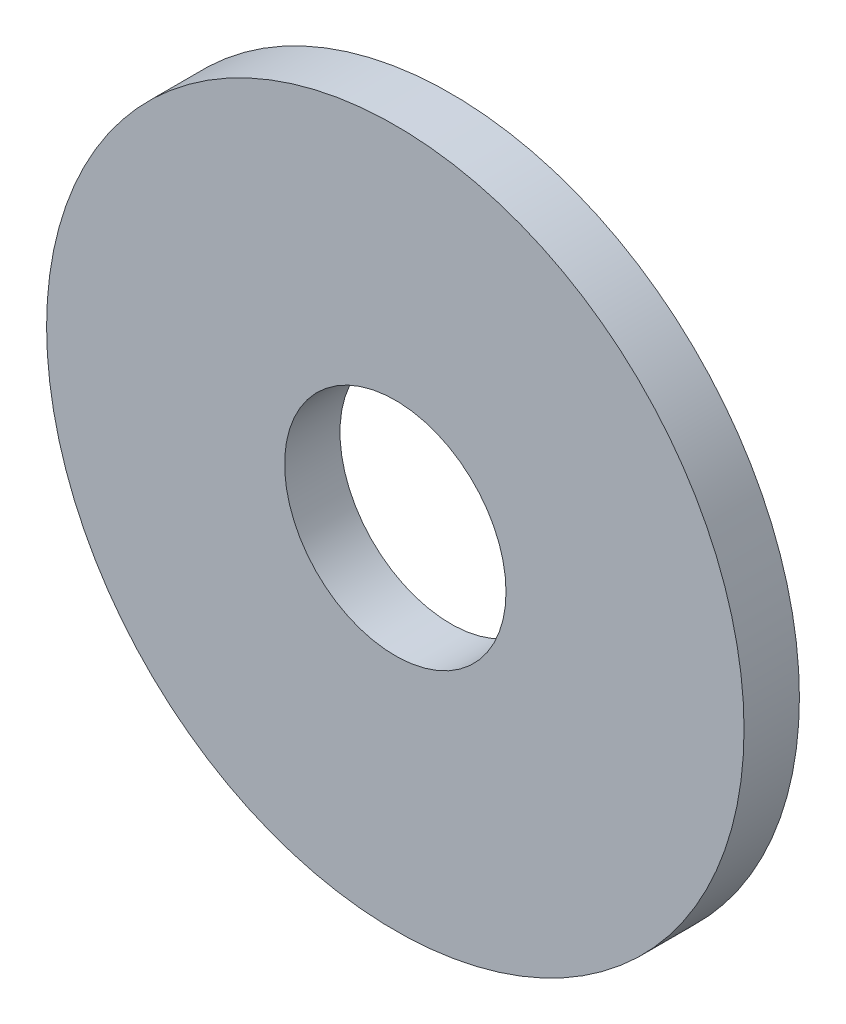
ISO-10303-21;
HEADER;
FILE_DESCRIPTION(('STEP AP214'),'2;1');
FILE_NAME('part.step','',(''),(''),'','','');
FILE_SCHEMA(('AUTOMOTIVE_DESIGN { 1 0 10303 214 1 1 1 1 }'));
ENDSEC;
DATA;
#1=APPLICATION_CONTEXT('core data for automotive mechanical design processes');
#2=APPLICATION_PROTOCOL_DEFINITION('international standard','automotive_design',2000,#1);
#3=PRODUCT_CONTEXT('',#1,'mechanical');
#4=PRODUCT('Part','Part','',(#3));
#5=PRODUCT_RELATED_PRODUCT_CATEGORY('part','',(#4));
#6=PRODUCT_DEFINITION_FORMATION('','',#4);
#7=PRODUCT_DEFINITION_CONTEXT('part definition',#1,'design');
#8=PRODUCT_DEFINITION('design','',#6,#7);
#9=PRODUCT_DEFINITION_SHAPE('','',#8);
#10=(LENGTH_UNIT() NAMED_UNIT(*) SI_UNIT(.MILLI.,.METRE.));
#11=(NAMED_UNIT(*) PLANE_ANGLE_UNIT() SI_UNIT($,.RADIAN.));
#12=(NAMED_UNIT(*) SI_UNIT($,.STERADIAN.) SOLID_ANGLE_UNIT());
#13=UNCERTAINTY_MEASURE_WITH_UNIT(LENGTH_MEASURE(1.E-05),#10,'distance_accuracy_value','');
#14=(GEOMETRIC_REPRESENTATION_CONTEXT(3) GLOBAL_UNCERTAINTY_ASSIGNED_CONTEXT((#13)) GLOBAL_UNIT_ASSIGNED_CONTEXT((#10,
#11,#12)) REPRESENTATION_CONTEXT('',''));
#15=CARTESIAN_POINT('',(0.,0.,0.));
#16=DIRECTION('',(0.,0.,1.));
#17=DIRECTION('',(1.,0.,0.));
#18=AXIS2_PLACEMENT_3D('',#15,#16,#17);
#19=CARTESIAN_POINT('',(0.,0.,-1.27));
#20=DIRECTION('',(0.,0.,1.));
#21=DIRECTION('',(1.,0.,0.));
#22=AXIS2_PLACEMENT_3D('',#19,#20,#21);
#23=CYLINDRICAL_SURFACE('',#22,8.001);
#24=CARTESIAN_POINT('',(0.,0.,-1.27));
#25=DIRECTION('',(0.,0.,1.));
#26=DIRECTION('',(1.,0.,0.));
#27=AXIS2_PLACEMENT_3D('',#24,#25,#26);
#28=CIRCLE('',#27,8.001);
#29=CARTESIAN_POINT('',(8.001,0.,-1.27));
#30=VERTEX_POINT('',#29);
#31=EDGE_CURVE('E10',#30,#30,#28,.T.);
#32=ORIENTED_EDGE('',*,*,#31,.T.);
#33=EDGE_LOOP('',(#32));
#34=FACE_BOUND('',#33,.T.);
#35=CARTESIAN_POINT('',(0.,0.,0.));
#36=DIRECTION('',(0.,0.,1.));
#37=DIRECTION('',(1.,0.,0.));
#38=AXIS2_PLACEMENT_3D('',#35,#36,#37);
#39=CIRCLE('',#38,8.001);
#40=CARTESIAN_POINT('',(8.001,0.,0.));
#41=VERTEX_POINT('',#40);
#42=EDGE_CURVE('E36',#41,#41,#39,.T.);
#43=ORIENTED_EDGE('',*,*,#42,.F.);
#44=EDGE_LOOP('',(#43));
#45=FACE_BOUND('',#44,.T.);
#46=ADVANCED_FACE('F33',(#34,#45),#23,.T.);
#47=CARTESIAN_POINT('',(0.,0.,-1.27));
#48=DIRECTION('',(0.,0.,1.));
#49=DIRECTION('',(1.,0.,0.));
#50=AXIS2_PLACEMENT_3D('',#47,#48,#49);
#51=PLANE('',#50);
#52=CARTESIAN_POINT('',(0.,0.,-1.27));
#53=DIRECTION('',(0.,0.,1.));
#54=DIRECTION('',(1.,0.,0.));
#55=AXIS2_PLACEMENT_3D('',#52,#53,#54);
#56=CIRCLE('',#55,2.54);
#57=CARTESIAN_POINT('',(2.54,0.,-1.27));
#58=VERTEX_POINT('',#57);
#59=EDGE_CURVE('E43',#58,#58,#56,.T.);
#60=ORIENTED_EDGE('',*,*,#59,.T.);
#61=EDGE_LOOP('',(#60));
#62=FACE_BOUND('',#61,.T.);
#63=ORIENTED_EDGE('',*,*,#31,.F.);
#64=EDGE_LOOP('',(#63));
#65=FACE_BOUND('',#64,.T.);
#66=ADVANCED_FACE('F51',(#62,#65),#51,.F.);
#67=CARTESIAN_POINT('',(0.,0.,0.));
#68=DIRECTION('',(0.,0.,1.));
#69=DIRECTION('',(1.,0.,0.));
#70=AXIS2_PLACEMENT_3D('',#67,#68,#69);
#71=PLANE('',#70);
#72=CARTESIAN_POINT('',(0.,0.,0.));
#73=DIRECTION('',(0.,0.,1.));
#74=DIRECTION('',(1.,0.,0.));
#75=AXIS2_PLACEMENT_3D('',#72,#73,#74);
#76=CIRCLE('',#75,2.54);
#77=CARTESIAN_POINT('',(2.54,0.,0.));
#78=VERTEX_POINT('',#77);
#79=EDGE_CURVE('E45',#78,#78,#76,.T.);
#80=ORIENTED_EDGE('',*,*,#79,.F.);
#81=EDGE_LOOP('',(#80));
#82=FACE_BOUND('',#81,.T.);
#83=ORIENTED_EDGE('',*,*,#42,.T.);
#84=EDGE_LOOP('',(#83));
#85=FACE_BOUND('',#84,.T.);
#86=ADVANCED_FACE('F57',(#82,#85),#71,.T.);
#87=CARTESIAN_POINT('',(0.,0.,-1.27));
#88=DIRECTION('',(0.,0.,1.));
#89=DIRECTION('',(1.,0.,0.));
#90=AXIS2_PLACEMENT_3D('',#87,#88,#89);
#91=CYLINDRICAL_SURFACE('',#90,2.54);
#92=ORIENTED_EDGE('',*,*,#59,.F.);
#93=EDGE_LOOP('',(#92));
#94=FACE_BOUND('',#93,.T.);
#95=ORIENTED_EDGE('',*,*,#79,.T.);
#96=EDGE_LOOP('',(#95));
#97=FACE_BOUND('',#96,.T.);
#98=ADVANCED_FACE('F54',(#94,#97),#91,.F.);
#99=CLOSED_SHELL('',(#46,#66,#86,#98));
#100=MANIFOLD_SOLID_BREP('B2',#99);
#101=ADVANCED_BREP_SHAPE_REPRESENTATION('',(#18,#100),#14);
#102=SHAPE_DEFINITION_REPRESENTATION(#9,#101);
ENDSEC;
END-ISO-10303-21;
